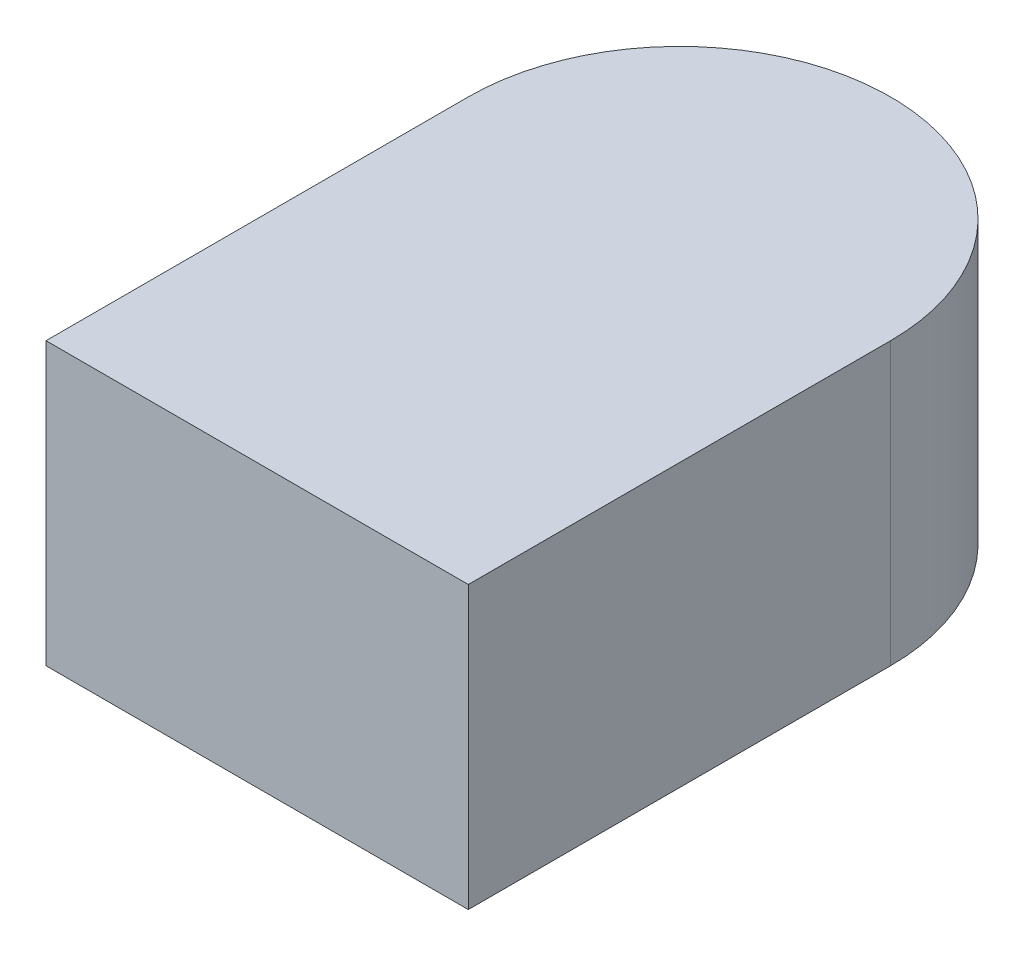
ISO-10303-21;
HEADER;
FILE_DESCRIPTION(('STEP AP214'),'2;1');
FILE_NAME('part.step','',(''),(''),'','','');
FILE_SCHEMA(('AUTOMOTIVE_DESIGN { 1 0 10303 214 1 1 1 1 }'));
ENDSEC;
DATA;
#1=APPLICATION_CONTEXT('core data for automotive mechanical design processes');
#2=APPLICATION_PROTOCOL_DEFINITION('international standard','automotive_design',2000,#1);
#3=PRODUCT_CONTEXT('',#1,'mechanical');
#4=PRODUCT('Part','Part','',(#3));
#5=PRODUCT_RELATED_PRODUCT_CATEGORY('part','',(#4));
#6=PRODUCT_DEFINITION_FORMATION('','',#4);
#7=PRODUCT_DEFINITION_CONTEXT('part definition',#1,'design');
#8=PRODUCT_DEFINITION('design','',#6,#7);
#9=PRODUCT_DEFINITION_SHAPE('','',#8);
#10=(LENGTH_UNIT() NAMED_UNIT(*) SI_UNIT(.MILLI.,.METRE.));
#11=(NAMED_UNIT(*) PLANE_ANGLE_UNIT() SI_UNIT($,.RADIAN.));
#12=(NAMED_UNIT(*) SI_UNIT($,.STERADIAN.) SOLID_ANGLE_UNIT());
#13=UNCERTAINTY_MEASURE_WITH_UNIT(LENGTH_MEASURE(1.E-05),#10,'distance_accuracy_value','');
#14=(GEOMETRIC_REPRESENTATION_CONTEXT(3) GLOBAL_UNCERTAINTY_ASSIGNED_CONTEXT((#13)) GLOBAL_UNIT_ASSIGNED_CONTEXT((#10,
#11,#12)) REPRESENTATION_CONTEXT('',''));
#15=CARTESIAN_POINT('',(0.,0.,0.));
#16=DIRECTION('',(0.,0.,1.));
#17=DIRECTION('',(1.,0.,0.));
#18=AXIS2_PLACEMENT_3D('',#15,#16,#17);
#19=CARTESIAN_POINT('',(0.,0.2,-0.15));
#20=DIRECTION('',(0.,-1.,0.));
#21=DIRECTION('',(0.,0.,-1.));
#22=AXIS2_PLACEMENT_3D('',#19,#20,#21);
#23=CYLINDRICAL_SURFACE('',#22,0.15);
#24=CARTESIAN_POINT('',(0.,0.,-0.15));
#25=DIRECTION('',(0.,1.,0.));
#26=DIRECTION('',(0.,0.,1.));
#27=AXIS2_PLACEMENT_3D('',#24,#25,#26);
#28=CIRCLE('',#27,0.15);
#29=CARTESIAN_POINT('',(0.15,0.,-0.15));
#30=VERTEX_POINT('',#29);
#31=CARTESIAN_POINT('',(-0.15,0.,-0.15));
#32=VERTEX_POINT('',#31);
#33=EDGE_CURVE('E107',#30,#32,#28,.T.);
#34=ORIENTED_EDGE('',*,*,#33,.T.);
#35=DIRECTION('',(0.,-1.,0.));
#36=VECTOR('',#35,1.);
#37=CARTESIAN_POINT('',(-0.15,0.2,-0.15));
#38=LINE('',#37,#36);
#39=CARTESIAN_POINT('',(-0.15,0.2,-0.15));
#40=VERTEX_POINT('',#39);
#41=EDGE_CURVE('E11',#40,#32,#38,.T.);
#42=ORIENTED_EDGE('',*,*,#41,.F.);
#43=CARTESIAN_POINT('',(0.,0.2,-0.15));
#44=DIRECTION('',(0.,1.,0.));
#45=DIRECTION('',(0.,0.,1.));
#46=AXIS2_PLACEMENT_3D('',#43,#44,#45);
#47=CIRCLE('',#46,0.15);
#48=CARTESIAN_POINT('',(0.15,0.2,-0.15));
#49=VERTEX_POINT('',#48);
#50=EDGE_CURVE('E91',#49,#40,#47,.T.);
#51=ORIENTED_EDGE('',*,*,#50,.F.);
#52=DIRECTION('',(0.,-1.,0.));
#53=VECTOR('',#52,1.);
#54=CARTESIAN_POINT('',(0.15,0.2,-0.15));
#55=LINE('',#54,#53);
#56=EDGE_CURVE('E103',#49,#30,#55,.T.);
#57=ORIENTED_EDGE('',*,*,#56,.T.);
#58=EDGE_LOOP('',(#34,#42,#51,#57));
#59=FACE_BOUND('',#58,.T.);
#60=ADVANCED_FACE('F39',(#59),#23,.T.);
#61=CARTESIAN_POINT('',(-0.15,0.2,0.15));
#62=DIRECTION('',(1.,0.,0.));
#63=DIRECTION('',(0.,0.,-1.));
#64=AXIS2_PLACEMENT_3D('',#61,#62,#63);
#65=PLANE('',#64);
#66=DIRECTION('',(0.,0.,1.));
#67=VECTOR('',#66,1.);
#68=CARTESIAN_POINT('',(-0.15,0.,0.15));
#69=LINE('',#68,#67);
#70=CARTESIAN_POINT('',(-0.15,0.,0.15));
#71=VERTEX_POINT('',#70);
#72=EDGE_CURVE('E96',#32,#71,#69,.T.);
#73=ORIENTED_EDGE('',*,*,#72,.T.);
#74=DIRECTION('',(0.,-1.,0.));
#75=VECTOR('',#74,1.);
#76=CARTESIAN_POINT('',(-0.15,0.2,0.15));
#77=LINE('',#76,#75);
#78=CARTESIAN_POINT('',(-0.15,0.2,0.15));
#79=VERTEX_POINT('',#78);
#80=EDGE_CURVE('E48',#79,#71,#77,.T.);
#81=ORIENTED_EDGE('',*,*,#80,.F.);
#82=DIRECTION('',(0.,0.,1.));
#83=VECTOR('',#82,1.);
#84=CARTESIAN_POINT('',(-0.15,0.2,0.15));
#85=LINE('',#84,#83);
#86=EDGE_CURVE('E86',#40,#79,#85,.T.);
#87=ORIENTED_EDGE('',*,*,#86,.F.);
#88=ORIENTED_EDGE('',*,*,#41,.T.);
#89=EDGE_LOOP('',(#73,#81,#87,#88));
#90=FACE_BOUND('',#89,.T.);
#91=ADVANCED_FACE('F95',(#90),#65,.F.);
#92=CARTESIAN_POINT('',(-0.15,0.2,0.15));
#93=DIRECTION('',(0.,0.,-1.));
#94=DIRECTION('',(-1.,0.,0.));
#95=AXIS2_PLACEMENT_3D('',#92,#93,#94);
#96=PLANE('',#95);
#97=DIRECTION('',(1.,0.,0.));
#98=VECTOR('',#97,1.);
#99=CARTESIAN_POINT('',(-0.15,0.,0.15));
#100=LINE('',#99,#98);
#101=CARTESIAN_POINT('',(0.15,0.,0.15));
#102=VERTEX_POINT('',#101);
#103=EDGE_CURVE('E73',#71,#102,#100,.T.);
#104=ORIENTED_EDGE('',*,*,#103,.T.);
#105=DIRECTION('',(0.,-1.,0.));
#106=VECTOR('',#105,1.);
#107=CARTESIAN_POINT('',(0.15,0.2,0.15));
#108=LINE('',#107,#106);
#109=CARTESIAN_POINT('',(0.15,0.2,0.15));
#110=VERTEX_POINT('',#109);
#111=EDGE_CURVE('E98',#110,#102,#108,.T.);
#112=ORIENTED_EDGE('',*,*,#111,.F.);
#113=DIRECTION('',(1.,0.,0.));
#114=VECTOR('',#113,1.);
#115=CARTESIAN_POINT('',(-0.15,0.2,0.15));
#116=LINE('',#115,#114);
#117=EDGE_CURVE('E89',#79,#110,#116,.T.);
#118=ORIENTED_EDGE('',*,*,#117,.F.);
#119=ORIENTED_EDGE('',*,*,#80,.T.);
#120=EDGE_LOOP('',(#104,#112,#118,#119));
#121=FACE_BOUND('',#120,.T.);
#122=ADVANCED_FACE('F99',(#121),#96,.F.);
#123=CARTESIAN_POINT('',(0.15,0.2,0.15));
#124=DIRECTION('',(-1.,0.,0.));
#125=DIRECTION('',(0.,0.,1.));
#126=AXIS2_PLACEMENT_3D('',#123,#124,#125);
#127=PLANE('',#126);
#128=DIRECTION('',(0.,0.,-1.));
#129=VECTOR('',#128,1.);
#130=CARTESIAN_POINT('',(0.15,0.,0.15));
#131=LINE('',#130,#129);
#132=EDGE_CURVE('E79',#102,#30,#131,.T.);
#133=ORIENTED_EDGE('',*,*,#132,.T.);
#134=ORIENTED_EDGE('',*,*,#56,.F.);
#135=DIRECTION('',(0.,0.,-1.));
#136=VECTOR('',#135,1.);
#137=CARTESIAN_POINT('',(0.15,0.2,0.15));
#138=LINE('',#137,#136);
#139=EDGE_CURVE('E56',#110,#49,#138,.T.);
#140=ORIENTED_EDGE('',*,*,#139,.F.);
#141=ORIENTED_EDGE('',*,*,#111,.T.);
#142=EDGE_LOOP('',(#133,#134,#140,#141));
#143=FACE_BOUND('',#142,.T.);
#144=ADVANCED_FACE('F120',(#143),#127,.F.);
#145=CARTESIAN_POINT('',(0.,0.2,-0.15));
#146=DIRECTION('',(0.,1.,0.));
#147=DIRECTION('',(0.,0.,1.));
#148=AXIS2_PLACEMENT_3D('',#145,#146,#147);
#149=PLANE('',#148);
#150=ORIENTED_EDGE('',*,*,#50,.T.);
#151=ORIENTED_EDGE('',*,*,#86,.T.);
#152=ORIENTED_EDGE('',*,*,#117,.T.);
#153=ORIENTED_EDGE('',*,*,#139,.T.);
#154=EDGE_LOOP('',(#150,#151,#152,#153));
#155=FACE_BOUND('',#154,.T.);
#156=ADVANCED_FACE('F87',(#155),#149,.T.);
#157=CARTESIAN_POINT('',(0.,0.,-0.15));
#158=DIRECTION('',(0.,1.,0.));
#159=DIRECTION('',(0.,0.,1.));
#160=AXIS2_PLACEMENT_3D('',#157,#158,#159);
#161=PLANE('',#160);
#162=ORIENTED_EDGE('',*,*,#33,.F.);
#163=ORIENTED_EDGE('',*,*,#132,.F.);
#164=ORIENTED_EDGE('',*,*,#103,.F.);
#165=ORIENTED_EDGE('',*,*,#72,.F.);
#166=EDGE_LOOP('',(#162,#163,#164,#165));
#167=FACE_BOUND('',#166,.T.);
#168=ADVANCED_FACE('F123',(#167),#161,.F.);
#169=CLOSED_SHELL('',(#60,#91,#122,#144,#156,#168));
#170=MANIFOLD_SOLID_BREP('B2',#169);
#171=ADVANCED_BREP_SHAPE_REPRESENTATION('',(#18,#170),#14);
#172=SHAPE_DEFINITION_REPRESENTATION(#9,#171);
ENDSEC;
END-ISO-10303-21;
